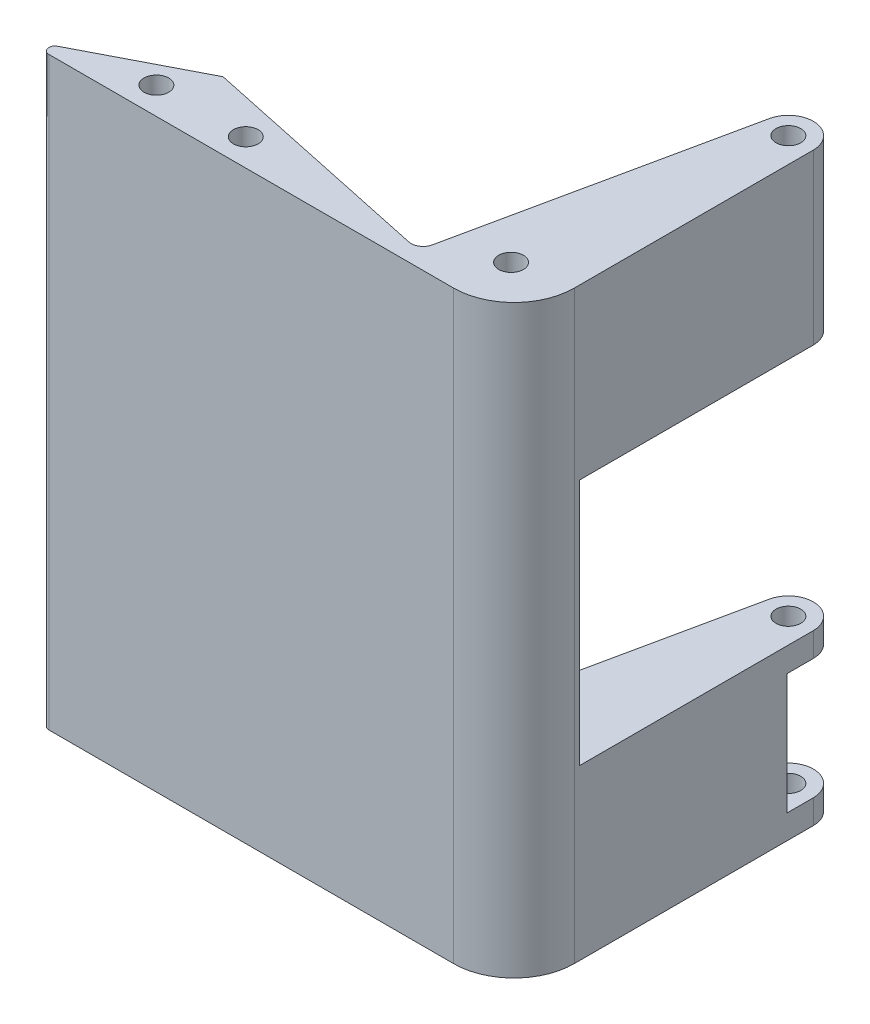
ISO-10303-21;
HEADER;
FILE_DESCRIPTION(('STEP AP214'),'2;1');
FILE_NAME('part.step','',(''),(''),'','','');
FILE_SCHEMA(('AUTOMOTIVE_DESIGN { 1 0 10303 214 1 1 1 1 }'));
ENDSEC;
DATA;
#1=APPLICATION_CONTEXT('core data for automotive mechanical design processes');
#2=APPLICATION_PROTOCOL_DEFINITION('international standard','automotive_design',2000,#1);
#3=PRODUCT_CONTEXT('',#1,'mechanical');
#4=PRODUCT('Part','Part','',(#3));
#5=PRODUCT_RELATED_PRODUCT_CATEGORY('part','',(#4));
#6=PRODUCT_DEFINITION_FORMATION('','',#4);
#7=PRODUCT_DEFINITION_CONTEXT('part definition',#1,'design');
#8=PRODUCT_DEFINITION('design','',#6,#7);
#9=PRODUCT_DEFINITION_SHAPE('','',#8);
#10=(LENGTH_UNIT() NAMED_UNIT(*) SI_UNIT(.MILLI.,.METRE.));
#11=(NAMED_UNIT(*) PLANE_ANGLE_UNIT() SI_UNIT($,.RADIAN.));
#12=(NAMED_UNIT(*) SI_UNIT($,.STERADIAN.) SOLID_ANGLE_UNIT());
#13=UNCERTAINTY_MEASURE_WITH_UNIT(LENGTH_MEASURE(1.E-05),#10,'distance_accuracy_value','');
#14=(GEOMETRIC_REPRESENTATION_CONTEXT(3) GLOBAL_UNCERTAINTY_ASSIGNED_CONTEXT((#13)) GLOBAL_UNIT_ASSIGNED_CONTEXT((#10,
#11,#12)) REPRESENTATION_CONTEXT('',''));
#15=CARTESIAN_POINT('',(0.,0.,0.));
#16=DIRECTION('',(0.,0.,1.));
#17=DIRECTION('',(1.,0.,0.));
#18=AXIS2_PLACEMENT_3D('',#15,#16,#17);
#19=CARTESIAN_POINT('',(18.3770393668177,97.,-47.1319255594641));
#20=DIRECTION('',(1.,0.,0.));
#21=DIRECTION('',(0.,0.,-1.));
#22=AXIS2_PLACEMENT_3D('',#19,#20,#21);
#23=PLANE('',#22);
#24=DIRECTION('',(0.,-1.,0.));
#25=VECTOR('',#24,1.);
#26=CARTESIAN_POINT('',(18.3770393668177,24.,-42.7834108887872));
#27=LINE('',#26,#25);
#28=CARTESIAN_POINT('',(18.3770393668177,24.,-42.7834108887872));
#29=VERTEX_POINT('',#28);
#30=CARTESIAN_POINT('',(18.3770393668177,4.,-42.7834108887872));
#31=VERTEX_POINT('',#30);
#32=EDGE_CURVE('E177',#29,#31,#27,.T.);
#33=ORIENTED_EDGE('',*,*,#32,.F.);
#34=DIRECTION('',(0.,0.,-1.));
#35=VECTOR('',#34,1.);
#36=CARTESIAN_POINT('',(18.3770393668177,24.,-47.1319255594641));
#37=LINE('',#36,#35);
#38=CARTESIAN_POINT('',(18.3770393668177,24.,-47.1319255594641));
#39=VERTEX_POINT('',#38);
#40=EDGE_CURVE('E188',#29,#39,#37,.T.);
#41=ORIENTED_EDGE('',*,*,#40,.T.);
#42=DIRECTION('',(0.,-1.,0.));
#43=VECTOR('',#42,1.);
#44=CARTESIAN_POINT('',(18.3770393668177,97.,-47.1319255594641));
#45=LINE('',#44,#43);
#46=CARTESIAN_POINT('',(18.3770393668177,28.0000000000001,-47.1319255594641));
#47=VERTEX_POINT('',#46);
#48=EDGE_CURVE('E380',#47,#39,#45,.T.);
#49=ORIENTED_EDGE('',*,*,#48,.F.);
#50=DIRECTION('',(0.,0.,-1.));
#51=VECTOR('',#50,1.);
#52=CARTESIAN_POINT('',(18.3770393668177,28.0000000000001,-47.1319255594641));
#53=LINE('',#52,#51);
#54=CARTESIAN_POINT('',(18.3770393668177,28.0000000000001,-8.36192683689498));
#55=VERTEX_POINT('',#54);
#56=EDGE_CURVE('E247',#55,#47,#53,.T.);
#57=ORIENTED_EDGE('',*,*,#56,.F.);
#58=DIRECTION('',(0.,1.,0.));
#59=VECTOR('',#58,1.);
#60=CARTESIAN_POINT('',(18.3770393668177,97.,-8.361926836895));
#61=LINE('',#60,#59);
#62=CARTESIAN_POINT('',(18.3770393668177,69.,-8.36192683689499));
#63=VERTEX_POINT('',#62);
#64=EDGE_CURVE('E251',#55,#63,#61,.T.);
#65=ORIENTED_EDGE('',*,*,#64,.T.);
#66=DIRECTION('',(0.,0.,-1.));
#67=VECTOR('',#66,1.);
#68=CARTESIAN_POINT('',(18.3770393668177,69.,-47.1319255594641));
#69=LINE('',#68,#67);
#70=CARTESIAN_POINT('',(18.3770393668177,69.,-47.1319255594641));
#71=VERTEX_POINT('',#70);
#72=EDGE_CURVE('E233',#63,#71,#69,.T.);
#73=ORIENTED_EDGE('',*,*,#72,.T.);
#74=CARTESIAN_POINT('',(18.3770393668177,97.,-47.1319255594641));
#75=VERTEX_POINT('',#74);
#76=EDGE_CURVE('E375',#75,#71,#45,.T.);
#77=ORIENTED_EDGE('',*,*,#76,.F.);
#78=DIRECTION('',(0.,0.,1.));
#79=VECTOR('',#78,1.);
#80=CARTESIAN_POINT('',(18.3770393668177,97.,-47.1319255594641));
#81=LINE('',#80,#79);
#82=CARTESIAN_POINT('',(18.3770393668177,97.,-7.5000000000001));
#83=VERTEX_POINT('',#82);
#84=EDGE_CURVE('E310',#75,#83,#81,.T.);
#85=ORIENTED_EDGE('',*,*,#84,.T.);
#86=DIRECTION('',(0.,-1.,0.));
#87=VECTOR('',#86,1.);
#88=CARTESIAN_POINT('',(18.3770393668177,97.,-7.5000000000001));
#89=LINE('',#88,#87);
#90=CARTESIAN_POINT('',(18.3770393668177,0.,-7.5000000000001));
#91=VERTEX_POINT('',#90);
#92=EDGE_CURVE('E379',#83,#91,#89,.T.);
#93=ORIENTED_EDGE('',*,*,#92,.T.);
#94=DIRECTION('',(0.,0.,1.));
#95=VECTOR('',#94,1.);
#96=CARTESIAN_POINT('',(18.3770393668177,0.,-47.1319255594641));
#97=LINE('',#96,#95);
#98=CARTESIAN_POINT('',(18.3770393668177,0.,-47.1319255594641));
#99=VERTEX_POINT('',#98);
#100=EDGE_CURVE('E347',#99,#91,#97,.T.);
#101=ORIENTED_EDGE('',*,*,#100,.F.);
#102=CARTESIAN_POINT('',(18.3770393668177,4.,-47.1319255594641));
#103=VERTEX_POINT('',#102);
#104=EDGE_CURVE('E199',#103,#99,#45,.T.);
#105=ORIENTED_EDGE('',*,*,#104,.F.);
#106=DIRECTION('',(0.,0.,-1.));
#107=VECTOR('',#106,1.);
#108=CARTESIAN_POINT('',(18.3770393668177,4.,-47.1319255594641));
#109=LINE('',#108,#107);
#110=EDGE_CURVE('E192',#31,#103,#109,.T.);
#111=ORIENTED_EDGE('',*,*,#110,.F.);
#112=EDGE_LOOP('',(#33,#41,#49,#57,#65,#73,#77,#85,#93,#101,#105,#111));
#113=FACE_BOUND('',#112,.T.);
#114=ADVANCED_FACE('F45',(#113),#23,.T.);
#115=CARTESIAN_POINT('',(14.2429832279986,97.,-47.1319255594641));
#116=DIRECTION('',(0.,-1.,0.));
#117=DIRECTION('',(0.,0.,-1.));
#118=AXIS2_PLACEMENT_3D('',#115,#116,#117);
#119=CYLINDRICAL_SURFACE('',#118,4.13405613881913);
#120=CARTESIAN_POINT('',(14.2429832279986,24.,-47.1319255594641));
#121=DIRECTION('',(0.,-1.,0.));
#122=DIRECTION('',(0.,0.,-1.));
#123=AXIS2_PLACEMENT_3D('',#120,#121,#122);
#124=CIRCLE('',#123,4.13405613881913);
#125=CARTESIAN_POINT('',(10.1991411572679,24.,-47.9908559791703));
#126=VERTEX_POINT('',#125);
#127=EDGE_CURVE('E206',#126,#39,#124,.T.);
#128=ORIENTED_EDGE('',*,*,#127,.F.);
#129=DIRECTION('',(0.,-1.,0.));
#130=VECTOR('',#129,1.);
#131=CARTESIAN_POINT('',(10.1991411572679,97.,-47.9908559791703));
#132=LINE('',#131,#130);
#133=CARTESIAN_POINT('',(10.1991411572679,28.0000000000001,-47.9908559791703));
#134=VERTEX_POINT('',#133);
#135=EDGE_CURVE('E374',#134,#126,#132,.T.);
#136=ORIENTED_EDGE('',*,*,#135,.F.);
#137=CARTESIAN_POINT('',(14.2429832279986,28.0000000000001,-47.1319255594641));
#138=DIRECTION('',(0.,-1.,0.));
#139=DIRECTION('',(0.,0.,-1.));
#140=AXIS2_PLACEMENT_3D('',#137,#138,#139);
#141=CIRCLE('',#140,4.13405613881913);
#142=EDGE_CURVE('E244',#134,#47,#141,.T.);
#143=ORIENTED_EDGE('',*,*,#142,.T.);
#144=ORIENTED_EDGE('',*,*,#48,.T.);
#145=EDGE_LOOP('',(#128,#136,#143,#144));
#146=FACE_BOUND('',#145,.T.);
#147=ADVANCED_FACE('F467',(#146),#119,.T.);
#148=CARTESIAN_POINT('',(7.9214354201565,97.,-37.267423587958));
#149=DIRECTION('',(-0.978177831877671,0.,-0.207769413588955));
#150=DIRECTION('',(-0.207769413588955,0.,0.978177831877671));
#151=AXIS2_PLACEMENT_3D('',#148,#149,#150);
#152=PLANE('',#151);
#153=ORIENTED_EDGE('',*,*,#135,.T.);
#154=DIRECTION('',(-0.207769413588955,0.,0.978177831877671));
#155=VECTOR('',#154,1.);
#156=CARTESIAN_POINT('',(7.9214354201565,24.,-37.267423587958));
#157=LINE('',#156,#155);
#158=CARTESIAN_POINT('',(9.29565281415842,24.,-43.7372353267194));
#159=VERTEX_POINT('',#158);
#160=EDGE_CURVE('E201',#126,#159,#157,.T.);
#161=ORIENTED_EDGE('',*,*,#160,.T.);
#162=DIRECTION('',(0.,-1.,0.));
#163=VECTOR('',#162,1.);
#164=CARTESIAN_POINT('',(9.29565281415842,24.,-43.7372353267194));
#165=LINE('',#164,#163);
#166=CARTESIAN_POINT('',(9.29565281415842,4.,-43.7372353267194));
#167=VERTEX_POINT('',#166);
#168=EDGE_CURVE('E11',#167,#159,#165,.F.);
#169=ORIENTED_EDGE('',*,*,#168,.F.);
#170=DIRECTION('',(-0.207769413588955,0.,0.978177831877671));
#171=VECTOR('',#170,1.);
#172=CARTESIAN_POINT('',(7.9214354201565,4.,-37.267423587958));
#173=LINE('',#172,#171);
#174=CARTESIAN_POINT('',(10.1991411572679,4.00000000000003,-47.9908559791703));
#175=VERTEX_POINT('',#174);
#176=EDGE_CURVE('E193',#175,#167,#173,.T.);
#177=ORIENTED_EDGE('',*,*,#176,.F.);
#178=CARTESIAN_POINT('',(10.1991411572679,0.,-47.9908559791703));
#179=VERTEX_POINT('',#178);
#180=EDGE_CURVE('E369',#175,#179,#132,.T.);
#181=ORIENTED_EDGE('',*,*,#180,.T.);
#182=DIRECTION('',(0.207769413588955,0.,-0.978177831877671));
#183=VECTOR('',#182,1.);
#184=CARTESIAN_POINT('',(7.9214354201565,0.,-37.267423587958));
#185=LINE('',#184,#183);
#186=CARTESIAN_POINT('',(7.9214354201565,0.,-37.267423587958));
#187=VERTEX_POINT('',#186);
#188=EDGE_CURVE('E355',#187,#179,#185,.T.);
#189=ORIENTED_EDGE('',*,*,#188,.F.);
#190=DIRECTION('',(0.,-1.,0.));
#191=VECTOR('',#190,1.);
#192=CARTESIAN_POINT('',(7.9214354201565,97.,-37.267423587958));
#193=LINE('',#192,#191);
#194=CARTESIAN_POINT('',(7.9214354201565,28.0000000000001,-37.267423587958));
#195=VERTEX_POINT('',#194);
#196=EDGE_CURVE('E364',#195,#187,#193,.T.);
#197=ORIENTED_EDGE('',*,*,#196,.F.);
#198=DIRECTION('',(-0.207769413588955,0.,0.978177831877671));
#199=VECTOR('',#198,1.);
#200=CARTESIAN_POINT('',(7.9214354201565,28.0000000000001,-37.267423587958));
#201=LINE('',#200,#199);
#202=EDGE_CURVE('E241',#134,#195,#201,.T.);
#203=ORIENTED_EDGE('',*,*,#202,.F.);
#204=EDGE_LOOP('',(#153,#161,#169,#177,#181,#189,#197,#203));
#205=FACE_BOUND('',#204,.T.);
#206=ADVANCED_FACE('F463',(#205),#152,.T.);
#207=CARTESIAN_POINT('',(14.2429832279986,0.,-47.1319255594641));
#208=DIRECTION('',(0.,1.,0.));
#209=DIRECTION('',(0.,0.,1.));
#210=AXIS2_PLACEMENT_3D('',#207,#208,#209);
#211=CYLINDRICAL_SURFACE('',#210,2.05);
#212=CARTESIAN_POINT('',(14.2429832279986,28.0000000000001,-47.1319255594641));
#213=DIRECTION('',(0.,-1.,0.));
#214=DIRECTION('',(0.,0.,-1.));
#215=AXIS2_PLACEMENT_3D('',#212,#213,#214);
#216=CIRCLE('',#215,2.05);
#217=CARTESIAN_POINT('',(14.2429832279986,28.0000000000001,-49.1819255594641));
#218=VERTEX_POINT('',#217);
#219=EDGE_CURVE('E237',#218,#218,#216,.F.);
#220=ORIENTED_EDGE('',*,*,#219,.T.);
#221=EDGE_LOOP('',(#220));
#222=FACE_BOUND('',#221,.T.);
#223=CARTESIAN_POINT('',(14.2429832279986,24.,-47.1319255594641));
#224=DIRECTION('',(0.,-1.,0.));
#225=DIRECTION('',(0.,0.,-1.));
#226=AXIS2_PLACEMENT_3D('',#223,#224,#225);
#227=CIRCLE('',#226,2.05);
#228=CARTESIAN_POINT('',(14.2429832279986,24.,-49.1819255594641));
#229=VERTEX_POINT('',#228);
#230=EDGE_CURVE('E472',#229,#229,#227,.F.);
#231=ORIENTED_EDGE('',*,*,#230,.F.);
#232=EDGE_LOOP('',(#231));
#233=FACE_BOUND('',#232,.T.);
#234=ADVANCED_FACE('F520',(#222,#233),#211,.F.);
#235=CARTESIAN_POINT('',(14.2429832279986,69.,-47.1319255594641));
#236=DIRECTION('',(0.,-1.,0.));
#237=DIRECTION('',(0.,0.,-1.));
#238=AXIS2_PLACEMENT_3D('',#235,#236,#237);
#239=CIRCLE('',#238,4.13405613881913);
#240=CARTESIAN_POINT('',(10.1991411572679,69.,-47.9908559791703));
#241=VERTEX_POINT('',#240);
#242=EDGE_CURVE('E230',#241,#71,#239,.T.);
#243=ORIENTED_EDGE('',*,*,#242,.F.);
#244=CARTESIAN_POINT('',(10.1991411572679,97.,-47.9908559791703));
#245=VERTEX_POINT('',#244);
#246=EDGE_CURVE('E370',#245,#241,#132,.T.);
#247=ORIENTED_EDGE('',*,*,#246,.F.);
#248=CARTESIAN_POINT('',(14.2429832279986,97.,-47.1319255594641));
#249=DIRECTION('',(0.,1.,0.));
#250=DIRECTION('',(0.,0.,1.));
#251=AXIS2_PLACEMENT_3D('',#248,#249,#250);
#252=CIRCLE('',#251,4.13405613881913);
#253=EDGE_CURVE('E314',#75,#245,#252,.T.);
#254=ORIENTED_EDGE('',*,*,#253,.F.);
#255=ORIENTED_EDGE('',*,*,#76,.T.);
#256=EDGE_LOOP('',(#243,#247,#254,#255));
#257=FACE_BOUND('',#256,.T.);
#258=ADVANCED_FACE('F499',(#257),#119,.T.);
#259=ORIENTED_EDGE('',*,*,#246,.T.);
#260=DIRECTION('',(-0.207769413588955,0.,0.978177831877671));
#261=VECTOR('',#260,1.);
#262=CARTESIAN_POINT('',(7.9214354201565,69.,-37.267423587958));
#263=LINE('',#262,#261);
#264=CARTESIAN_POINT('',(7.9214354201565,69.,-37.267423587958));
#265=VERTEX_POINT('',#264);
#266=EDGE_CURVE('E226',#241,#265,#263,.T.);
#267=ORIENTED_EDGE('',*,*,#266,.T.);
#268=CARTESIAN_POINT('',(7.9214354201565,97.,-37.267423587958));
#269=VERTEX_POINT('',#268);
#270=EDGE_CURVE('E365',#269,#265,#193,.T.);
#271=ORIENTED_EDGE('',*,*,#270,.F.);
#272=DIRECTION('',(0.207769413588955,0.,-0.978177831877671));
#273=VECTOR('',#272,1.);
#274=CARTESIAN_POINT('',(7.9214354201565,97.,-37.267423587958));
#275=LINE('',#274,#273);
#276=EDGE_CURVE('E317',#269,#245,#275,.T.);
#277=ORIENTED_EDGE('',*,*,#276,.T.);
#278=EDGE_LOOP('',(#259,#267,#271,#277));
#279=FACE_BOUND('',#278,.T.);
#280=ADVANCED_FACE('F517',(#279),#152,.T.);
#281=CARTESIAN_POINT('',(14.2429832279986,97.,-47.1319255594641));
#282=DIRECTION('',(0.,1.,0.));
#283=DIRECTION('',(0.,0.,1.));
#284=AXIS2_PLACEMENT_3D('',#281,#282,#283);
#285=CIRCLE('',#284,2.05);
#286=CARTESIAN_POINT('',(14.2429832279986,97.,-45.0819255594641));
#287=VERTEX_POINT('',#286);
#288=EDGE_CURVE('E273',#287,#287,#285,.T.);
#289=ORIENTED_EDGE('',*,*,#288,.T.);
#290=EDGE_LOOP('',(#289));
#291=FACE_BOUND('',#290,.T.);
#292=CARTESIAN_POINT('',(14.2429832279986,69.,-47.1319255594641));
#293=DIRECTION('',(0.,-1.,0.));
#294=DIRECTION('',(0.,0.,-1.));
#295=AXIS2_PLACEMENT_3D('',#292,#293,#294);
#296=CIRCLE('',#295,2.05);
#297=CARTESIAN_POINT('',(14.2429832279986,69.,-49.1819255594641));
#298=VERTEX_POINT('',#297);
#299=EDGE_CURVE('E219',#298,#298,#296,.F.);
#300=ORIENTED_EDGE('',*,*,#299,.F.);
#301=EDGE_LOOP('',(#300));
#302=FACE_BOUND('',#301,.T.);
#303=ADVANCED_FACE('F513',(#291,#302),#211,.F.);
#304=CARTESIAN_POINT('',(-1.5404718198321,97.,-2.37211858310312));
#305=DIRECTION('',(0.,-1.,0.));
#306=DIRECTION('',(0.,0.,-1.));
#307=AXIS2_PLACEMENT_3D('',#304,#305,#306);
#308=CYLINDRICAL_SURFACE('',#307,2.);
#309=CARTESIAN_POINT('',(-1.5404718198321,0.,-2.37211858310312));
#310=DIRECTION('',(0.,-1.,0.));
#311=DIRECTION('',(0.,0.,-1.));
#312=AXIS2_PLACEMENT_3D('',#309,#310,#311);
#313=CIRCLE('',#312,2.);
#314=CARTESIAN_POINT('',(0.415823381635515,0.,-1.95629520146763));
#315=VERTEX_POINT('',#314);
#316=CARTESIAN_POINT('',(-1.95629520146763,0.,-0.415823381635514));
#317=VERTEX_POINT('',#316);
#318=EDGE_CURVE('E260',#315,#317,#313,.T.);
#319=ORIENTED_EDGE('',*,*,#318,.T.);
#320=DIRECTION('',(0.,-1.,0.));
#321=VECTOR('',#320,1.);
#322=CARTESIAN_POINT('',(-1.95629520146763,97.,-0.415823381635514));
#323=LINE('',#322,#321);
#324=CARTESIAN_POINT('',(-1.95629520146763,97.,-0.415823381635514));
#325=VERTEX_POINT('',#324);
#326=EDGE_CURVE('E397',#325,#317,#323,.T.);
#327=ORIENTED_EDGE('',*,*,#326,.F.);
#328=CARTESIAN_POINT('',(-1.5404718198321,97.,-2.37211858310312));
#329=DIRECTION('',(0.,-1.,0.));
#330=DIRECTION('',(0.,0.,-1.));
#331=AXIS2_PLACEMENT_3D('',#328,#329,#330);
#332=CIRCLE('',#331,2.);
#333=CARTESIAN_POINT('',(0.415823381635515,97.,-1.95629520146763));
#334=VERTEX_POINT('',#333);
#335=EDGE_CURVE('E288',#334,#325,#332,.T.);
#336=ORIENTED_EDGE('',*,*,#335,.F.);
#337=DIRECTION('',(0.,-1.,0.));
#338=VECTOR('',#337,1.);
#339=CARTESIAN_POINT('',(0.415823381635515,97.,-1.95629520146763));
#340=LINE('',#339,#338);
#341=EDGE_CURVE('E325',#334,#315,#340,.T.);
#342=ORIENTED_EDGE('',*,*,#341,.T.);
#343=EDGE_LOOP('',(#319,#327,#336,#342));
#344=FACE_BOUND('',#343,.T.);
#345=ADVANCED_FACE('F47',(#344),#308,.F.);
#346=CARTESIAN_POINT('',(-1.95629520146763,97.,-0.415823381635514));
#347=DIRECTION('',(-0.207911690817756,0.,0.978147600733806));
#348=DIRECTION('',(0.978147600733806,0.,0.207911690817756));
#349=AXIS2_PLACEMENT_3D('',#346,#347,#348);
#350=PLANE('',#349);
#351=DIRECTION('',(-0.978147600733807,0.,-0.207911690817756));
#352=VECTOR('',#351,1.);
#353=CARTESIAN_POINT('',(-1.95629520146763,0.,-0.415823381635514));
#354=LINE('',#353,#352);
#355=CARTESIAN_POINT('',(-41.0821992308199,0.,-8.73229101434574));
#356=VERTEX_POINT('',#355);
#357=EDGE_CURVE('E329',#317,#356,#354,.T.);
#358=ORIENTED_EDGE('',*,*,#357,.T.);
#359=DIRECTION('',(0.,-1.,0.));
#360=VECTOR('',#359,1.);
#361=CARTESIAN_POINT('',(-41.0821992308199,97.,-8.73229101434574));
#362=LINE('',#361,#360);
#363=CARTESIAN_POINT('',(-41.0821992308199,97.,-8.73229101434574));
#364=VERTEX_POINT('',#363);
#365=EDGE_CURVE('E393',#364,#356,#362,.T.);
#366=ORIENTED_EDGE('',*,*,#365,.F.);
#367=DIRECTION('',(-0.978147600733807,0.,-0.207911690817756));
#368=VECTOR('',#367,1.);
#369=CARTESIAN_POINT('',(-1.95629520146763,97.,-0.415823381635514));
#370=LINE('',#369,#368);
#371=EDGE_CURVE('E292',#325,#364,#370,.T.);
#372=ORIENTED_EDGE('',*,*,#371,.F.);
#373=ORIENTED_EDGE('',*,*,#326,.T.);
#374=EDGE_LOOP('',(#358,#366,#372,#373));
#375=FACE_BOUND('',#374,.T.);
#376=ADVANCED_FACE('F454',(#375),#350,.F.);
#377=CARTESIAN_POINT('',(-59.1844982343188,97.,0.611390536463435));
#378=DIRECTION('',(-0.458664606562723,0.,-0.88860946353652));
#379=DIRECTION('',(-0.88860946353652,0.,0.458664606562723));
#380=AXIS2_PLACEMENT_3D('',#377,#378,#379);
#381=PLANE('',#380);
#382=DIRECTION('',(0.88860946353652,0.,-0.458664606562723));
#383=VECTOR('',#382,1.);
#384=CARTESIAN_POINT('',(-59.1844982343188,0.,0.611390536463435));
#385=LINE('',#384,#383);
#386=CARTESIAN_POINT('',(-59.1844982343188,0.,0.611390536463435));
#387=VERTEX_POINT('',#386);
#388=EDGE_CURVE('E333',#387,#356,#385,.T.);
#389=ORIENTED_EDGE('',*,*,#388,.F.);
#390=DIRECTION('',(0.,-1.,0.));
#391=VECTOR('',#390,1.);
#392=CARTESIAN_POINT('',(-59.1844982343188,97.,0.611390536463435));
#393=LINE('',#392,#391);
#394=CARTESIAN_POINT('',(-59.1844982343188,97.,0.611390536463435));
#395=VERTEX_POINT('',#394);
#396=EDGE_CURVE('E390',#395,#387,#393,.T.);
#397=ORIENTED_EDGE('',*,*,#396,.F.);
#398=DIRECTION('',(-0.88860946353652,0.,0.458664606562723));
#399=VECTOR('',#398,1.);
#400=CARTESIAN_POINT('',(-41.0821992308199,97.,-8.73229101434574));
#401=LINE('',#400,#399);
#402=EDGE_CURVE('E296',#364,#395,#401,.T.);
#403=ORIENTED_EDGE('',*,*,#402,.F.);
#404=ORIENTED_EDGE('',*,*,#365,.T.);
#405=EDGE_LOOP('',(#389,#397,#403,#404));
#406=FACE_BOUND('',#405,.T.);
#407=ADVANCED_FACE('F451',(#406),#381,.T.);
#408=CARTESIAN_POINT('',(-58.7258336277561,97.,1.49999999999998));
#409=DIRECTION('',(0.,-1.,0.));
#410=DIRECTION('',(0.,0.,-1.));
#411=AXIS2_PLACEMENT_3D('',#408,#409,#410);
#412=CYLINDRICAL_SURFACE('',#411,1.);
#413=CARTESIAN_POINT('',(-58.7258336277561,0.,1.49999999999998));
#414=DIRECTION('',(0.,1.,0.));
#415=DIRECTION('',(0.,0.,1.));
#416=AXIS2_PLACEMENT_3D('',#413,#414,#415);
#417=CIRCLE('',#416,1.);
#418=CARTESIAN_POINT('',(-58.7258336277561,0.,2.49999999999999));
#419=VERTEX_POINT('',#418);
#420=EDGE_CURVE('E336',#387,#419,#417,.T.);
#421=ORIENTED_EDGE('',*,*,#420,.T.);
#422=DIRECTION('',(0.,-1.,0.));
#423=VECTOR('',#422,1.);
#424=CARTESIAN_POINT('',(-58.7258336277561,97.,2.49999999999999));
#425=LINE('',#424,#423);
#426=CARTESIAN_POINT('',(-58.7258336277561,97.,2.49999999999999));
#427=VERTEX_POINT('',#426);
#428=EDGE_CURVE('E386',#427,#419,#425,.T.);
#429=ORIENTED_EDGE('',*,*,#428,.F.);
#430=CARTESIAN_POINT('',(-58.7258336277561,97.,1.49999999999998));
#431=DIRECTION('',(0.,1.,0.));
#432=DIRECTION('',(0.,0.,1.));
#433=AXIS2_PLACEMENT_3D('',#430,#431,#432);
#434=CIRCLE('',#433,1.);
#435=EDGE_CURVE('E299',#395,#427,#434,.T.);
#436=ORIENTED_EDGE('',*,*,#435,.F.);
#437=ORIENTED_EDGE('',*,*,#396,.T.);
#438=EDGE_LOOP('',(#421,#429,#436,#437));
#439=FACE_BOUND('',#438,.T.);
#440=ADVANCED_FACE('F447',(#439),#412,.T.);
#441=CARTESIAN_POINT('',(8.37703936681768,97.,2.49999999999998));
#442=DIRECTION('',(0.,0.,1.));
#443=DIRECTION('',(1.,0.,0.));
#444=AXIS2_PLACEMENT_3D('',#441,#442,#443);
#445=PLANE('',#444);
#446=DIRECTION('',(-1.,0.,0.));
#447=VECTOR('',#446,1.);
#448=CARTESIAN_POINT('',(8.37703936681768,0.,2.49999999999998));
#449=LINE('',#448,#447);
#450=CARTESIAN_POINT('',(8.37703936681768,0.,2.49999999999998));
#451=VERTEX_POINT('',#450);
#452=EDGE_CURVE('E340',#451,#419,#449,.T.);
#453=ORIENTED_EDGE('',*,*,#452,.F.);
#454=DIRECTION('',(0.,-1.,0.));
#455=VECTOR('',#454,1.);
#456=CARTESIAN_POINT('',(8.37703936681768,97.,2.49999999999998));
#457=LINE('',#456,#455);
#458=CARTESIAN_POINT('',(8.37703936681768,97.,2.49999999999998));
#459=VERTEX_POINT('',#458);
#460=EDGE_CURVE('E383',#459,#451,#457,.T.);
#461=ORIENTED_EDGE('',*,*,#460,.F.);
#462=DIRECTION('',(-1.,0.,0.));
#463=VECTOR('',#462,1.);
#464=CARTESIAN_POINT('',(7.92143542015651,97.,2.49999999999998));
#465=LINE('',#464,#463);
#466=EDGE_CURVE('E302',#459,#427,#465,.T.);
#467=ORIENTED_EDGE('',*,*,#466,.T.);
#468=ORIENTED_EDGE('',*,*,#428,.T.);
#469=EDGE_LOOP('',(#453,#461,#467,#468));
#470=FACE_BOUND('',#469,.T.);
#471=ADVANCED_FACE('F444',(#470),#445,.T.);
#472=CARTESIAN_POINT('',(8.37703936681775,97.,-7.50000000000002));
#473=DIRECTION('',(0.,-1.,0.));
#474=DIRECTION('',(0.,0.,-1.));
#475=AXIS2_PLACEMENT_3D('',#472,#473,#474);
#476=CYLINDRICAL_SURFACE('',#475,10.);
#477=CARTESIAN_POINT('',(8.37703936681775,0.,-7.50000000000002));
#478=DIRECTION('',(0.,-1.,0.));
#479=DIRECTION('',(0.,0.,-1.));
#480=AXIS2_PLACEMENT_3D('',#477,#478,#479);
#481=CIRCLE('',#480,10.);
#482=EDGE_CURVE('E343',#91,#451,#481,.T.);
#483=ORIENTED_EDGE('',*,*,#482,.F.);
#484=ORIENTED_EDGE('',*,*,#92,.F.);
#485=CARTESIAN_POINT('',(8.37703936681775,97.,-7.50000000000002));
#486=DIRECTION('',(0.,-1.,0.));
#487=DIRECTION('',(0.,0.,-1.));
#488=AXIS2_PLACEMENT_3D('',#485,#486,#487);
#489=CIRCLE('',#488,10.);
#490=EDGE_CURVE('E306',#83,#459,#489,.T.);
#491=ORIENTED_EDGE('',*,*,#490,.T.);
#492=ORIENTED_EDGE('',*,*,#460,.T.);
#493=EDGE_LOOP('',(#483,#484,#491,#492));
#494=FACE_BOUND('',#493,.T.);
#495=ADVANCED_FACE('F437',(#494),#476,.T.);
#496=ORIENTED_EDGE('',*,*,#180,.F.);
#497=CARTESIAN_POINT('',(14.2429832279986,4.,-47.1319255594641));
#498=DIRECTION('',(0.,-1.,0.));
#499=DIRECTION('',(0.,0.,-1.));
#500=AXIS2_PLACEMENT_3D('',#497,#498,#499);
#501=CIRCLE('',#500,4.13405613881913);
#502=EDGE_CURVE('E61',#175,#103,#501,.T.);
#503=ORIENTED_EDGE('',*,*,#502,.T.);
#504=ORIENTED_EDGE('',*,*,#104,.T.);
#505=CARTESIAN_POINT('',(14.2429832279986,0.,-47.1319255594641));
#506=DIRECTION('',(0.,1.,0.));
#507=DIRECTION('',(0.,0.,1.));
#508=AXIS2_PLACEMENT_3D('',#505,#506,#507);
#509=CIRCLE('',#508,4.13405613881913);
#510=EDGE_CURVE('E351',#99,#179,#509,.T.);
#511=ORIENTED_EDGE('',*,*,#510,.T.);
#512=EDGE_LOOP('',(#496,#503,#504,#511));
#513=FACE_BOUND('',#512,.T.);
#514=ADVANCED_FACE('F428',(#513),#119,.T.);
#515=CARTESIAN_POINT('',(0.415823381635515,97.,-1.95629520146763));
#516=DIRECTION('',(-0.978147600733806,0.,-0.207911690817756));
#517=DIRECTION('',(-0.207911690817756,0.,0.978147600733806));
#518=AXIS2_PLACEMENT_3D('',#515,#516,#517);
#519=PLANE('',#518);
#520=DIRECTION('',(-0.207911690817756,0.,0.978147600733806));
#521=VECTOR('',#520,1.);
#522=CARTESIAN_POINT('',(0.415823381635515,28.0000000000001,-1.95629520146763));
#523=LINE('',#522,#521);
#524=CARTESIAN_POINT('',(2.49494028981307,28.0000000000001,-11.7377712088057));
#525=VERTEX_POINT('',#524);
#526=EDGE_CURVE('E238',#195,#525,#523,.T.);
#527=ORIENTED_EDGE('',*,*,#526,.F.);
#528=ORIENTED_EDGE('',*,*,#196,.T.);
#529=DIRECTION('',(0.207911690817756,0.,-0.978147600733806));
#530=VECTOR('',#529,1.);
#531=CARTESIAN_POINT('',(0.415823381635515,0.,-1.95629520146763));
#532=LINE('',#531,#530);
#533=EDGE_CURVE('E293',#315,#187,#532,.T.);
#534=ORIENTED_EDGE('',*,*,#533,.F.);
#535=ORIENTED_EDGE('',*,*,#341,.F.);
#536=DIRECTION('',(0.207911690817756,0.,-0.978147600733806));
#537=VECTOR('',#536,1.);
#538=CARTESIAN_POINT('',(0.415823381635515,97.,-1.95629520146763));
#539=LINE('',#538,#537);
#540=EDGE_CURVE('E321',#334,#269,#539,.T.);
#541=ORIENTED_EDGE('',*,*,#540,.T.);
#542=ORIENTED_EDGE('',*,*,#270,.T.);
#543=DIRECTION('',(-0.207911690817756,0.,0.978147600733806));
#544=VECTOR('',#543,1.);
#545=CARTESIAN_POINT('',(0.415823381635515,69.,-1.95629520146763));
#546=LINE('',#545,#544);
#547=CARTESIAN_POINT('',(2.49494028981307,69.,-11.7377712088057));
#548=VERTEX_POINT('',#547);
#549=EDGE_CURVE('E222',#265,#548,#546,.T.);
#550=ORIENTED_EDGE('',*,*,#549,.T.);
#551=DIRECTION('',(0.,-1.,0.));
#552=VECTOR('',#551,1.);
#553=CARTESIAN_POINT('',(2.49494028981307,97.,-11.7377712088057));
#554=LINE('',#553,#552);
#555=EDGE_CURVE('E54',#548,#525,#554,.T.);
#556=ORIENTED_EDGE('',*,*,#555,.T.);
#557=EDGE_LOOP('',(#527,#528,#534,#535,#541,#542,#550,#556));
#558=FACE_BOUND('',#557,.T.);
#559=ADVANCED_FACE('F410',(#558),#519,.T.);
#560=CARTESIAN_POINT('',(-1.5404718198321,97.,-2.37211858310312));
#561=DIRECTION('',(0.,-1.,0.));
#562=DIRECTION('',(0.,0.,-1.));
#563=AXIS2_PLACEMENT_3D('',#560,#561,#562);
#564=PLANE('',#563);
#565=CARTESIAN_POINT('',(-45.4070040933112,97.,-2.00000000000002));
#566=DIRECTION('',(0.,1.,0.));
#567=DIRECTION('',(0.,0.,1.));
#568=AXIS2_PLACEMENT_3D('',#565,#566,#567);
#569=CIRCLE('',#568,2.04999999999999);
#570=CARTESIAN_POINT('',(-45.4070040933112,97.,0.0499999999999706));
#571=VERTEX_POINT('',#570);
#572=EDGE_CURVE('E261',#571,#571,#569,.T.);
#573=ORIENTED_EDGE('',*,*,#572,.F.);
#574=EDGE_LOOP('',(#573));
#575=FACE_BOUND('',#574,.T.);
#576=CARTESIAN_POINT('',(9.44467189350352,97.,-5.9558130063686));
#577=DIRECTION('',(0.,1.,0.));
#578=DIRECTION('',(0.,0.,1.));
#579=AXIS2_PLACEMENT_3D('',#576,#577,#578);
#580=CIRCLE('',#579,2.05);
#581=CARTESIAN_POINT('',(9.44467189350352,97.,-3.9058130063686));
#582=VERTEX_POINT('',#581);
#583=EDGE_CURVE('E265',#582,#582,#580,.T.);
#584=ORIENTED_EDGE('',*,*,#583,.F.);
#585=EDGE_LOOP('',(#584));
#586=FACE_BOUND('',#585,.T.);
#587=ORIENTED_EDGE('',*,*,#288,.F.);
#588=EDGE_LOOP('',(#587));
#589=FACE_BOUND('',#588,.T.);
#590=CARTESIAN_POINT('',(-30.5800957116106,97.,-2.00000000000002));
#591=DIRECTION('',(0.,1.,0.));
#592=DIRECTION('',(0.,0.,1.));
#593=AXIS2_PLACEMENT_3D('',#590,#591,#592);
#594=CIRCLE('',#593,2.05);
#595=CARTESIAN_POINT('',(-30.5800957116106,97.,0.0499999999999776));
#596=VERTEX_POINT('',#595);
#597=EDGE_CURVE('E281',#596,#596,#594,.T.);
#598=ORIENTED_EDGE('',*,*,#597,.F.);
#599=EDGE_LOOP('',(#598));
#600=FACE_BOUND('',#599,.T.);
#601=ORIENTED_EDGE('',*,*,#335,.T.);
#602=ORIENTED_EDGE('',*,*,#371,.T.);
#603=ORIENTED_EDGE('',*,*,#402,.T.);
#604=ORIENTED_EDGE('',*,*,#435,.T.);
#605=ORIENTED_EDGE('',*,*,#466,.F.);
#606=ORIENTED_EDGE('',*,*,#490,.F.);
#607=ORIENTED_EDGE('',*,*,#84,.F.);
#608=ORIENTED_EDGE('',*,*,#253,.T.);
#609=ORIENTED_EDGE('',*,*,#276,.F.);
#610=ORIENTED_EDGE('',*,*,#540,.F.);
#611=EDGE_LOOP('',(#601,#602,#603,#604,#605,#606,#607,#608,#609,#610));
#612=FACE_BOUND('',#611,.T.);
#613=ADVANCED_FACE('F565',(#575,#586,#589,#600,#612),#564,.F.);
#614=CARTESIAN_POINT('',(-1.5404718198321,0.,-2.37211858310312));
#615=DIRECTION('',(0.,-1.,0.));
#616=DIRECTION('',(0.,0.,-1.));
#617=AXIS2_PLACEMENT_3D('',#614,#615,#616);
#618=PLANE('',#617);
#619=CARTESIAN_POINT('',(-45.4070040933112,0.,-2.00000000000002));
#620=DIRECTION('',(0.,1.,0.));
#621=DIRECTION('',(0.,0.,1.));
#622=AXIS2_PLACEMENT_3D('',#619,#620,#621);
#623=CIRCLE('',#622,2.04999999999999);
#624=CARTESIAN_POINT('',(-45.4070040933112,0.,0.0499999999999706));
#625=VERTEX_POINT('',#624);
#626=EDGE_CURVE('E256',#625,#625,#623,.T.);
#627=ORIENTED_EDGE('',*,*,#626,.T.);
#628=EDGE_LOOP('',(#627));
#629=FACE_BOUND('',#628,.T.);
#630=CARTESIAN_POINT('',(9.44467189350352,0.,-5.9558130063686));
#631=DIRECTION('',(0.,1.,0.));
#632=DIRECTION('',(0.,0.,1.));
#633=AXIS2_PLACEMENT_3D('',#630,#631,#632);
#634=CIRCLE('',#633,2.05);
#635=CARTESIAN_POINT('',(9.44467189350352,0.,-3.9058130063686));
#636=VERTEX_POINT('',#635);
#637=EDGE_CURVE('E269',#636,#636,#634,.T.);
#638=ORIENTED_EDGE('',*,*,#637,.T.);
#639=EDGE_LOOP('',(#638));
#640=FACE_BOUND('',#639,.T.);
#641=CARTESIAN_POINT('',(14.2429832279986,0.,-47.1319255594641));
#642=DIRECTION('',(0.,1.,0.));
#643=DIRECTION('',(0.,0.,1.));
#644=AXIS2_PLACEMENT_3D('',#641,#642,#643);
#645=CIRCLE('',#644,2.05);
#646=CARTESIAN_POINT('',(14.2429832279986,0.,-45.0819255594641));
#647=VERTEX_POINT('',#646);
#648=EDGE_CURVE('E277',#647,#647,#645,.T.);
#649=ORIENTED_EDGE('',*,*,#648,.T.);
#650=EDGE_LOOP('',(#649));
#651=FACE_BOUND('',#650,.T.);
#652=CARTESIAN_POINT('',(-30.5800957116106,0.,-2.00000000000002));
#653=DIRECTION('',(0.,1.,0.));
#654=DIRECTION('',(0.,0.,1.));
#655=AXIS2_PLACEMENT_3D('',#652,#653,#654);
#656=CIRCLE('',#655,2.05);
#657=CARTESIAN_POINT('',(-30.5800957116106,0.,0.0499999999999776));
#658=VERTEX_POINT('',#657);
#659=EDGE_CURVE('E255',#658,#658,#656,.T.);
#660=ORIENTED_EDGE('',*,*,#659,.T.);
#661=EDGE_LOOP('',(#660));
#662=FACE_BOUND('',#661,.T.);
#663=ORIENTED_EDGE('',*,*,#318,.F.);
#664=ORIENTED_EDGE('',*,*,#533,.T.);
#665=ORIENTED_EDGE('',*,*,#188,.T.);
#666=ORIENTED_EDGE('',*,*,#510,.F.);
#667=ORIENTED_EDGE('',*,*,#100,.T.);
#668=ORIENTED_EDGE('',*,*,#482,.T.);
#669=ORIENTED_EDGE('',*,*,#452,.T.);
#670=ORIENTED_EDGE('',*,*,#420,.F.);
#671=ORIENTED_EDGE('',*,*,#388,.T.);
#672=ORIENTED_EDGE('',*,*,#357,.F.);
#673=EDGE_LOOP('',(#663,#664,#665,#666,#667,#668,#669,#670,#671,#672));
#674=FACE_BOUND('',#673,.T.);
#675=ADVANCED_FACE('F431',(#629,#640,#651,#662,#674),#618,.T.);
#676=CARTESIAN_POINT('',(-30.5800957116106,0.,-2.00000000000002));
#677=DIRECTION('',(0.,1.,0.));
#678=DIRECTION('',(0.,0.,1.));
#679=AXIS2_PLACEMENT_3D('',#676,#677,#678);
#680=CYLINDRICAL_SURFACE('',#679,2.05);
#681=ORIENTED_EDGE('',*,*,#659,.F.);
#682=EDGE_LOOP('',(#681));
#683=FACE_BOUND('',#682,.T.);
#684=ORIENTED_EDGE('',*,*,#597,.T.);
#685=EDGE_LOOP('',(#684));
#686=FACE_BOUND('',#685,.T.);
#687=ADVANCED_FACE('F531',(#683,#686),#680,.F.);
#688=CARTESIAN_POINT('',(14.2429832279986,4.,-47.1319255594641));
#689=DIRECTION('',(0.,-1.,0.));
#690=DIRECTION('',(0.,0.,-1.));
#691=AXIS2_PLACEMENT_3D('',#688,#689,#690);
#692=CIRCLE('',#691,2.05);
#693=CARTESIAN_POINT('',(14.2429832279986,4.,-49.1819255594641));
#694=VERTEX_POINT('',#693);
#695=EDGE_CURVE('E195',#694,#694,#692,.F.);
#696=ORIENTED_EDGE('',*,*,#695,.T.);
#697=EDGE_LOOP('',(#696));
#698=FACE_BOUND('',#697,.T.);
#699=ORIENTED_EDGE('',*,*,#648,.F.);
#700=EDGE_LOOP('',(#699));
#701=FACE_BOUND('',#700,.T.);
#702=ADVANCED_FACE('F483',(#698,#701),#211,.F.);
#703=CARTESIAN_POINT('',(9.44467189350352,0.,-5.9558130063686));
#704=DIRECTION('',(0.,1.,0.));
#705=DIRECTION('',(0.,0.,1.));
#706=AXIS2_PLACEMENT_3D('',#703,#704,#705);
#707=CYLINDRICAL_SURFACE('',#706,2.05);
#708=ORIENTED_EDGE('',*,*,#637,.F.);
#709=EDGE_LOOP('',(#708));
#710=FACE_BOUND('',#709,.T.);
#711=ORIENTED_EDGE('',*,*,#583,.T.);
#712=EDGE_LOOP('',(#711));
#713=FACE_BOUND('',#712,.T.);
#714=ADVANCED_FACE('F530',(#710,#713),#707,.F.);
#715=CARTESIAN_POINT('',(-45.4070040933112,0.,-2.00000000000002));
#716=DIRECTION('',(0.,1.,0.));
#717=DIRECTION('',(0.,0.,1.));
#718=AXIS2_PLACEMENT_3D('',#715,#716,#717);
#719=CYLINDRICAL_SURFACE('',#718,2.04999999999999);
#720=ORIENTED_EDGE('',*,*,#626,.F.);
#721=EDGE_LOOP('',(#720));
#722=FACE_BOUND('',#721,.T.);
#723=ORIENTED_EDGE('',*,*,#572,.T.);
#724=EDGE_LOOP('',(#723));
#725=FACE_BOUND('',#724,.T.);
#726=ADVANCED_FACE('F545',(#722,#725),#719,.F.);
#727=CARTESIAN_POINT('',(18.0910709064914,28.0000000000001,3.84537582881233));
#728=DIRECTION('',(0.,-1.,0.));
#729=DIRECTION('',(0.,0.,-1.));
#730=AXIS2_PLACEMENT_3D('',#727,#728,#729);
#731=PLANE('',#730);
#732=ORIENTED_EDGE('',*,*,#56,.T.);
#733=ORIENTED_EDGE('',*,*,#142,.F.);
#734=ORIENTED_EDGE('',*,*,#202,.T.);
#735=ORIENTED_EDGE('',*,*,#526,.T.);
#736=DIRECTION('',(-0.978147600733806,0.,-0.207911690817756));
#737=VECTOR('',#736,1.);
#738=CARTESIAN_POINT('',(20.5860111963045,28.0000000000001,-7.89239537999335));
#739=LINE('',#738,#737);
#740=EDGE_CURVE('E215',#55,#525,#739,.T.);
#741=ORIENTED_EDGE('',*,*,#740,.F.);
#742=EDGE_LOOP('',(#732,#733,#734,#735,#741));
#743=FACE_BOUND('',#742,.T.);
#744=ORIENTED_EDGE('',*,*,#219,.F.);
#745=EDGE_LOOP('',(#744));
#746=FACE_BOUND('',#745,.T.);
#747=ADVANCED_FACE('F417',(#743,#746),#731,.F.);
#748=CARTESIAN_POINT('',(18.0910709064914,69.,3.84537582881233));
#749=DIRECTION('',(0.,-1.,0.));
#750=DIRECTION('',(0.,0.,-1.));
#751=AXIS2_PLACEMENT_3D('',#748,#749,#750);
#752=PLANE('',#751);
#753=ORIENTED_EDGE('',*,*,#299,.T.);
#754=EDGE_LOOP('',(#753));
#755=FACE_BOUND('',#754,.T.);
#756=DIRECTION('',(-0.978147600733806,0.,-0.207911690817756));
#757=VECTOR('',#756,1.);
#758=CARTESIAN_POINT('',(20.5860111963045,69.,-7.89239537999335));
#759=LINE('',#758,#757);
#760=EDGE_CURVE('E69',#63,#548,#759,.T.);
#761=ORIENTED_EDGE('',*,*,#760,.T.);
#762=ORIENTED_EDGE('',*,*,#549,.F.);
#763=ORIENTED_EDGE('',*,*,#266,.F.);
#764=ORIENTED_EDGE('',*,*,#242,.T.);
#765=ORIENTED_EDGE('',*,*,#72,.F.);
#766=EDGE_LOOP('',(#761,#762,#763,#764,#765));
#767=FACE_BOUND('',#766,.T.);
#768=ADVANCED_FACE('F544',(#755,#767),#752,.T.);
#769=CARTESIAN_POINT('',(20.5860111963045,0.,-7.89239537999334));
#770=DIRECTION('',(0.207911690817756,0.,-0.978147600733806));
#771=DIRECTION('',(-0.978147600733806,0.,-0.207911690817756));
#772=AXIS2_PLACEMENT_3D('',#769,#770,#771);
#773=PLANE('',#772);
#774=ORIENTED_EDGE('',*,*,#740,.T.);
#775=ORIENTED_EDGE('',*,*,#555,.F.);
#776=ORIENTED_EDGE('',*,*,#760,.F.);
#777=ORIENTED_EDGE('',*,*,#64,.F.);
#778=EDGE_LOOP('',(#774,#775,#776,#777));
#779=FACE_BOUND('',#778,.T.);
#780=ADVANCED_FACE('F413',(#779),#773,.T.);
#781=CARTESIAN_POINT('',(14.2429832279986,24.,-47.1319255594641));
#782=DIRECTION('',(0.,-1.,0.));
#783=DIRECTION('',(0.,0.,-1.));
#784=AXIS2_PLACEMENT_3D('',#781,#782,#783);
#785=CYLINDRICAL_SURFACE('',#784,6.);
#786=ORIENTED_EDGE('',*,*,#32,.T.);
#787=CARTESIAN_POINT('',(14.2429832279986,4.,-47.1319255594641));
#788=DIRECTION('',(0.,-1.,0.));
#789=DIRECTION('',(0.,0.,-1.));
#790=AXIS2_PLACEMENT_3D('',#787,#788,#789);
#791=CIRCLE('',#790,6.);
#792=EDGE_CURVE('E180',#31,#167,#791,.T.);
#793=ORIENTED_EDGE('',*,*,#792,.T.);
#794=ORIENTED_EDGE('',*,*,#168,.T.);
#795=CARTESIAN_POINT('',(14.2429832279986,24.,-47.1319255594641));
#796=DIRECTION('',(0.,-1.,0.));
#797=DIRECTION('',(0.,0.,-1.));
#798=AXIS2_PLACEMENT_3D('',#795,#796,#797);
#799=CIRCLE('',#798,6.);
#800=EDGE_CURVE('E183',#29,#159,#799,.T.);
#801=ORIENTED_EDGE('',*,*,#800,.F.);
#802=EDGE_LOOP('',(#786,#793,#794,#801));
#803=FACE_BOUND('',#802,.T.);
#804=ADVANCED_FACE('F179',(#803),#785,.F.);
#805=CARTESIAN_POINT('',(0.,24.,0.));
#806=DIRECTION('',(0.,-1.,0.));
#807=DIRECTION('',(0.,0.,-1.));
#808=AXIS2_PLACEMENT_3D('',#805,#806,#807);
#809=PLANE('',#808);
#810=ORIENTED_EDGE('',*,*,#800,.T.);
#811=ORIENTED_EDGE('',*,*,#160,.F.);
#812=ORIENTED_EDGE('',*,*,#127,.T.);
#813=ORIENTED_EDGE('',*,*,#40,.F.);
#814=EDGE_LOOP('',(#810,#811,#812,#813));
#815=FACE_BOUND('',#814,.T.);
#816=ORIENTED_EDGE('',*,*,#230,.T.);
#817=EDGE_LOOP('',(#816));
#818=FACE_BOUND('',#817,.T.);
#819=ADVANCED_FACE('F469',(#815,#818),#809,.T.);
#820=CARTESIAN_POINT('',(0.,4.,0.));
#821=DIRECTION('',(0.,-1.,0.));
#822=DIRECTION('',(0.,0.,-1.));
#823=AXIS2_PLACEMENT_3D('',#820,#821,#822);
#824=PLANE('',#823);
#825=ORIENTED_EDGE('',*,*,#110,.T.);
#826=ORIENTED_EDGE('',*,*,#502,.F.);
#827=ORIENTED_EDGE('',*,*,#176,.T.);
#828=ORIENTED_EDGE('',*,*,#792,.F.);
#829=EDGE_LOOP('',(#825,#826,#827,#828));
#830=FACE_BOUND('',#829,.T.);
#831=ORIENTED_EDGE('',*,*,#695,.F.);
#832=EDGE_LOOP('',(#831));
#833=FACE_BOUND('',#832,.T.);
#834=ADVANCED_FACE('F190',(#830,#833),#824,.F.);
#835=CLOSED_SHELL('',(#114,#147,#206,#234,#258,#280,#303,#345,#376,#407,#440,#471,#495,#514,
#559,#613,#675,#687,#702,#714,#726,#747,#768,#780,#804,#819,#834));
#836=MANIFOLD_SOLID_BREP('B2',#835);
#837=ADVANCED_BREP_SHAPE_REPRESENTATION('',(#18,#836),#14);
#838=SHAPE_DEFINITION_REPRESENTATION(#9,#837);
ENDSEC;
END-ISO-10303-21;
